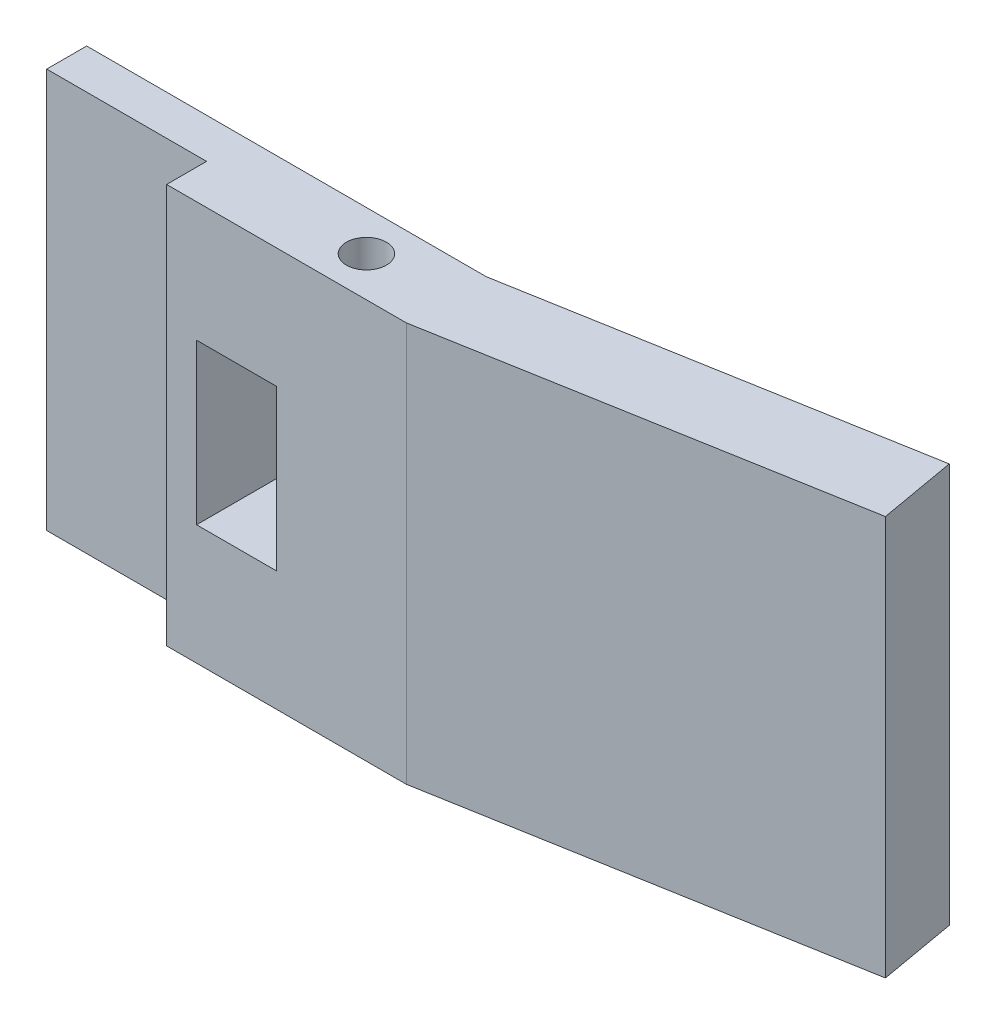
ISO-10303-21;
HEADER;
FILE_DESCRIPTION(('STEP AP214'),'2;1');
FILE_NAME('part.step','',(''),(''),'','','');
FILE_SCHEMA(('AUTOMOTIVE_DESIGN { 1 0 10303 214 1 1 1 1 }'));
ENDSEC;
DATA;
#1=APPLICATION_CONTEXT('core data for automotive mechanical design processes');
#2=APPLICATION_PROTOCOL_DEFINITION('international standard','automotive_design',2000,#1);
#3=PRODUCT_CONTEXT('',#1,'mechanical');
#4=PRODUCT('Part','Part','',(#3));
#5=PRODUCT_RELATED_PRODUCT_CATEGORY('part','',(#4));
#6=PRODUCT_DEFINITION_FORMATION('','',#4);
#7=PRODUCT_DEFINITION_CONTEXT('part definition',#1,'design');
#8=PRODUCT_DEFINITION('design','',#6,#7);
#9=PRODUCT_DEFINITION_SHAPE('','',#8);
#10=(LENGTH_UNIT() NAMED_UNIT(*) SI_UNIT(.MILLI.,.METRE.));
#11=(NAMED_UNIT(*) PLANE_ANGLE_UNIT() SI_UNIT($,.RADIAN.));
#12=(NAMED_UNIT(*) SI_UNIT($,.STERADIAN.) SOLID_ANGLE_UNIT());
#13=UNCERTAINTY_MEASURE_WITH_UNIT(LENGTH_MEASURE(1.E-05),#10,'distance_accuracy_value','');
#14=(GEOMETRIC_REPRESENTATION_CONTEXT(3) GLOBAL_UNCERTAINTY_ASSIGNED_CONTEXT((#13)) GLOBAL_UNIT_ASSIGNED_CONTEXT((#10,
#11,#12)) REPRESENTATION_CONTEXT('',''));
#15=CARTESIAN_POINT('',(0.,0.,0.));
#16=DIRECTION('',(0.,0.,1.));
#17=DIRECTION('',(1.,0.,0.));
#18=AXIS2_PLACEMENT_3D('',#15,#16,#17);
#19=CARTESIAN_POINT('',(25.4,31.75,3.175));
#20=DIRECTION('',(0.,-1.,0.));
#21=DIRECTION('',(0.,0.,-1.));
#22=AXIS2_PLACEMENT_3D('',#19,#20,#21);
#23=CYLINDRICAL_SURFACE('',#22,1.5875);
#24=CARTESIAN_POINT('',(25.4,31.75,3.175));
#25=DIRECTION('',(0.,1.,0.));
#26=DIRECTION('',(0.,0.,1.));
#27=AXIS2_PLACEMENT_3D('',#24,#25,#26);
#28=CIRCLE('',#27,1.5875);
#29=CARTESIAN_POINT('',(25.4,31.75,4.7625));
#30=VERTEX_POINT('',#29);
#31=EDGE_CURVE('E192',#30,#30,#28,.T.);
#32=ORIENTED_EDGE('',*,*,#31,.T.);
#33=EDGE_LOOP('',(#32));
#34=FACE_BOUND('',#33,.T.);
#35=CARTESIAN_POINT('',(25.4,0.,3.175));
#36=DIRECTION('',(0.,1.,0.));
#37=DIRECTION('',(0.,0.,1.));
#38=AXIS2_PLACEMENT_3D('',#35,#36,#37);
#39=CIRCLE('',#38,1.5875);
#40=CARTESIAN_POINT('',(25.4,0.,4.7625));
#41=VERTEX_POINT('',#40);
#42=EDGE_CURVE('E174',#41,#41,#39,.T.);
#43=ORIENTED_EDGE('',*,*,#42,.F.);
#44=EDGE_LOOP('',(#43));
#45=FACE_BOUND('',#44,.T.);
#46=ADVANCED_FACE('F44',(#34,#45),#23,.F.);
#47=CARTESIAN_POINT('',(62.060266513114,31.75,-10.9428994162196));
#48=DIRECTION('',(0.984807753012209,0.,-0.173648177666923));
#49=DIRECTION('',(-0.173648177666923,0.,-0.984807753012209));
#50=AXIS2_PLACEMENT_3D('',#47,#48,#49);
#51=PLANE('',#50);
#52=DIRECTION('',(0.173648177666923,0.,0.984807753012209));
#53=VECTOR('',#52,1.);
#54=CARTESIAN_POINT('',(62.060266513114,0.,-10.9428994162196));
#55=LINE('',#54,#53);
#56=CARTESIAN_POINT('',(63.0176461581377,0.,-5.51332964092484));
#57=VERTEX_POINT('',#56);
#58=CARTESIAN_POINT('',(64.1035601131966,0.,0.645194430070445));
#59=VERTEX_POINT('',#58);
#60=EDGE_CURVE('E201',#57,#59,#55,.T.);
#61=ORIENTED_EDGE('',*,*,#60,.F.);
#62=DIRECTION('',(0.,-1.,0.));
#63=VECTOR('',#62,1.);
#64=CARTESIAN_POINT('',(63.0176461581377,31.75,-5.51332964092484));
#65=LINE('',#64,#63);
#66=CARTESIAN_POINT('',(63.0176461581377,31.75,-5.51332964092484));
#67=VERTEX_POINT('',#66);
#68=EDGE_CURVE('E233',#67,#57,#65,.T.);
#69=ORIENTED_EDGE('',*,*,#68,.F.);
#70=DIRECTION('',(0.173648177666923,0.,0.984807753012209));
#71=VECTOR('',#70,1.);
#72=CARTESIAN_POINT('',(62.060266513114,31.75,-10.9428994162196));
#73=LINE('',#72,#71);
#74=CARTESIAN_POINT('',(64.1035601131966,31.75,0.645194430070445));
#75=VERTEX_POINT('',#74);
#76=EDGE_CURVE('E173',#67,#75,#73,.T.);
#77=ORIENTED_EDGE('',*,*,#76,.T.);
#78=DIRECTION('',(0.,-1.,0.));
#79=VECTOR('',#78,1.);
#80=CARTESIAN_POINT('',(64.1035601131966,31.75,0.645194430070445));
#81=LINE('',#80,#79);
#82=EDGE_CURVE('E236',#75,#59,#81,.T.);
#83=ORIENTED_EDGE('',*,*,#82,.T.);
#84=EDGE_LOOP('',(#61,#69,#77,#83));
#85=FACE_BOUND('',#84,.T.);
#86=ADVANCED_FACE('F289',(#85),#51,.T.);
#87=CARTESIAN_POINT('',(2.04329360008259,31.75,11.5880938462901));
#88=DIRECTION('',(0.173648177666924,0.,0.984807753012209));
#89=DIRECTION('',(0.984807753012209,0.,-0.173648177666924));
#90=AXIS2_PLACEMENT_3D('',#87,#88,#89);
#91=PLANE('',#90);
#92=DIRECTION('',(-0.984807753012209,0.,0.173648177666924));
#93=VECTOR('',#92,1.);
#94=CARTESIAN_POINT('',(2.04329360008259,0.,11.5880938462901));
#95=LINE('',#94,#93);
#96=CARTESIAN_POINT('',(31.75,0.,6.35));
#97=VERTEX_POINT('',#96);
#98=EDGE_CURVE('E197',#59,#97,#95,.T.);
#99=ORIENTED_EDGE('',*,*,#98,.F.);
#100=ORIENTED_EDGE('',*,*,#82,.F.);
#101=DIRECTION('',(-0.984807753012209,0.,0.173648177666924));
#102=VECTOR('',#101,1.);
#103=CARTESIAN_POINT('',(2.04329360008259,31.75,11.5880938462901));
#104=LINE('',#103,#102);
#105=CARTESIAN_POINT('',(31.75,31.75,6.35));
#106=VERTEX_POINT('',#105);
#107=EDGE_CURVE('E169',#75,#106,#104,.T.);
#108=ORIENTED_EDGE('',*,*,#107,.T.);
#109=DIRECTION('',(0.,-1.,0.));
#110=VECTOR('',#109,1.);
#111=CARTESIAN_POINT('',(31.75,31.75,6.35));
#112=LINE('',#111,#110);
#113=EDGE_CURVE('E196',#106,#97,#112,.T.);
#114=ORIENTED_EDGE('',*,*,#113,.T.);
#115=EDGE_LOOP('',(#99,#100,#108,#114));
#116=FACE_BOUND('',#115,.T.);
#117=ADVANCED_FACE('F295',(#116),#91,.T.);
#118=CARTESIAN_POINT('',(0.957379645023635,31.75,5.4295697752948));
#119=DIRECTION('',(-0.173648177666924,0.,-0.984807753012209));
#120=DIRECTION('',(-0.984807753012209,0.,0.173648177666924));
#121=AXIS2_PLACEMENT_3D('',#118,#119,#120);
#122=PLANE('',#121);
#123=DIRECTION('',(0.984807753012209,0.,-0.173648177666924));
#124=VECTOR('',#123,1.);
#125=CARTESIAN_POINT('',(0.957379645023635,0.,5.4295697752948));
#126=LINE('',#125,#124);
#127=CARTESIAN_POINT('',(31.75,0.,0.));
#128=VERTEX_POINT('',#127);
#129=EDGE_CURVE('E206',#128,#57,#126,.T.);
#130=ORIENTED_EDGE('',*,*,#129,.F.);
#131=DIRECTION('',(0.,-1.,0.));
#132=VECTOR('',#131,1.);
#133=CARTESIAN_POINT('',(31.75,31.75,0.));
#134=LINE('',#133,#132);
#135=CARTESIAN_POINT('',(31.75,31.75,0.));
#136=VERTEX_POINT('',#135);
#137=EDGE_CURVE('E230',#136,#128,#134,.T.);
#138=ORIENTED_EDGE('',*,*,#137,.F.);
#139=DIRECTION('',(0.984807753012209,0.,-0.173648177666924));
#140=VECTOR('',#139,1.);
#141=CARTESIAN_POINT('',(0.957379645023635,31.75,5.4295697752948));
#142=LINE('',#141,#140);
#143=EDGE_CURVE('E178',#136,#67,#142,.T.);
#144=ORIENTED_EDGE('',*,*,#143,.T.);
#145=ORIENTED_EDGE('',*,*,#68,.T.);
#146=EDGE_LOOP('',(#130,#138,#144,#145));
#147=FACE_BOUND('',#146,.T.);
#148=ADVANCED_FACE('F304',(#147),#122,.T.);
#149=CARTESIAN_POINT('',(0.,31.75,6.35));
#150=DIRECTION('',(0.,0.,-1.));
#151=DIRECTION('',(-1.,0.,0.));
#152=AXIS2_PLACEMENT_3D('',#149,#150,#151);
#153=PLANE('',#152);
#154=DIRECTION('',(1.,0.,0.));
#155=VECTOR('',#154,1.);
#156=CARTESIAN_POINT('',(15.08125,9.525,6.35));
#157=LINE('',#156,#155);
#158=CARTESIAN_POINT('',(15.08125,9.525,6.35));
#159=VERTEX_POINT('',#158);
#160=CARTESIAN_POINT('',(21.43125,9.525,6.35));
#161=VERTEX_POINT('',#160);
#162=EDGE_CURVE('E146',#159,#161,#157,.T.);
#163=ORIENTED_EDGE('',*,*,#162,.F.);
#164=DIRECTION('',(0.,-1.,0.));
#165=VECTOR('',#164,1.);
#166=CARTESIAN_POINT('',(15.08125,22.225,6.35));
#167=LINE('',#166,#165);
#168=CARTESIAN_POINT('',(15.08125,22.225,6.35));
#169=VERTEX_POINT('',#168);
#170=EDGE_CURVE('E60',#169,#159,#167,.T.);
#171=ORIENTED_EDGE('',*,*,#170,.F.);
#172=DIRECTION('',(-1.,0.,0.));
#173=VECTOR('',#172,1.);
#174=CARTESIAN_POINT('',(15.08125,22.225,6.35));
#175=LINE('',#174,#173);
#176=CARTESIAN_POINT('',(21.43125,22.225,6.35));
#177=VERTEX_POINT('',#176);
#178=EDGE_CURVE('E154',#177,#169,#175,.T.);
#179=ORIENTED_EDGE('',*,*,#178,.F.);
#180=DIRECTION('',(0.,1.,0.));
#181=VECTOR('',#180,1.);
#182=CARTESIAN_POINT('',(21.43125,22.225,6.35));
#183=LINE('',#182,#181);
#184=EDGE_CURVE('E136',#161,#177,#183,.T.);
#185=ORIENTED_EDGE('',*,*,#184,.F.);
#186=EDGE_LOOP('',(#163,#171,#179,#185));
#187=FACE_BOUND('',#186,.T.);
#188=DIRECTION('',(1.,0.,0.));
#189=VECTOR('',#188,1.);
#190=CARTESIAN_POINT('',(0.,0.,6.35));
#191=LINE('',#190,#189);
#192=CARTESIAN_POINT('',(12.7,0.,6.35));
#193=VERTEX_POINT('',#192);
#194=EDGE_CURVE('E217',#193,#97,#191,.T.);
#195=ORIENTED_EDGE('',*,*,#194,.T.);
#196=ORIENTED_EDGE('',*,*,#113,.F.);
#197=DIRECTION('',(1.,0.,0.));
#198=VECTOR('',#197,1.);
#199=CARTESIAN_POINT('',(0.,31.75,6.35));
#200=LINE('',#199,#198);
#201=CARTESIAN_POINT('',(12.7,31.75,6.35));
#202=VERTEX_POINT('',#201);
#203=EDGE_CURVE('E189',#202,#106,#200,.T.);
#204=ORIENTED_EDGE('',*,*,#203,.F.);
#205=DIRECTION('',(0.,-1.,0.));
#206=VECTOR('',#205,1.);
#207=CARTESIAN_POINT('',(12.7,31.75,6.35));
#208=LINE('',#207,#206);
#209=EDGE_CURVE('E226',#202,#193,#208,.T.);
#210=ORIENTED_EDGE('',*,*,#209,.T.);
#211=EDGE_LOOP('',(#195,#196,#204,#210));
#212=FACE_BOUND('',#211,.T.);
#213=ADVANCED_FACE('F151',(#187,#212),#153,.F.);
#214=CARTESIAN_POINT('',(0.,0.,0.));
#215=DIRECTION('',(0.,1.,0.));
#216=DIRECTION('',(0.,0.,1.));
#217=AXIS2_PLACEMENT_3D('',#214,#215,#216);
#218=PLANE('',#217);
#219=ORIENTED_EDGE('',*,*,#98,.T.);
#220=ORIENTED_EDGE('',*,*,#194,.F.);
#221=DIRECTION('',(0.,0.,1.));
#222=VECTOR('',#221,1.);
#223=CARTESIAN_POINT('',(12.7,0.,0.));
#224=LINE('',#223,#222);
#225=CARTESIAN_POINT('',(12.7,0.,3.175));
#226=VERTEX_POINT('',#225);
#227=EDGE_CURVE('E214',#226,#193,#224,.T.);
#228=ORIENTED_EDGE('',*,*,#227,.F.);
#229=DIRECTION('',(1.,0.,0.));
#230=VECTOR('',#229,1.);
#231=CARTESIAN_POINT('',(0.,0.,3.175));
#232=LINE('',#231,#230);
#233=CARTESIAN_POINT('',(0.,0.,3.175));
#234=VERTEX_POINT('',#233);
#235=EDGE_CURVE('E164',#234,#226,#232,.T.);
#236=ORIENTED_EDGE('',*,*,#235,.F.);
#237=DIRECTION('',(0.,0.,1.));
#238=VECTOR('',#237,1.);
#239=CARTESIAN_POINT('',(0.,0.,0.));
#240=LINE('',#239,#238);
#241=CARTESIAN_POINT('',(0.,0.,0.));
#242=VERTEX_POINT('',#241);
#243=EDGE_CURVE('E245',#242,#234,#240,.T.);
#244=ORIENTED_EDGE('',*,*,#243,.F.);
#245=DIRECTION('',(1.,0.,0.));
#246=VECTOR('',#245,1.);
#247=CARTESIAN_POINT('',(0.,0.,0.));
#248=LINE('',#247,#246);
#249=EDGE_CURVE('E210',#242,#128,#248,.T.);
#250=ORIENTED_EDGE('',*,*,#249,.T.);
#251=ORIENTED_EDGE('',*,*,#129,.T.);
#252=ORIENTED_EDGE('',*,*,#60,.T.);
#253=EDGE_LOOP('',(#219,#220,#228,#236,#244,#250,#251,#252));
#254=FACE_BOUND('',#253,.T.);
#255=ORIENTED_EDGE('',*,*,#42,.T.);
#256=EDGE_LOOP('',(#255));
#257=FACE_BOUND('',#256,.T.);
#258=ADVANCED_FACE('F301',(#254,#257),#218,.F.);
#259=CARTESIAN_POINT('',(0.,31.75,0.));
#260=DIRECTION('',(0.,1.,0.));
#261=DIRECTION('',(0.,0.,1.));
#262=AXIS2_PLACEMENT_3D('',#259,#260,#261);
#263=PLANE('',#262);
#264=ORIENTED_EDGE('',*,*,#107,.F.);
#265=ORIENTED_EDGE('',*,*,#76,.F.);
#266=ORIENTED_EDGE('',*,*,#143,.F.);
#267=DIRECTION('',(1.,0.,0.));
#268=VECTOR('',#267,1.);
#269=CARTESIAN_POINT('',(0.,31.75,0.));
#270=LINE('',#269,#268);
#271=CARTESIAN_POINT('',(0.,31.75,0.));
#272=VERTEX_POINT('',#271);
#273=EDGE_CURVE('E182',#272,#136,#270,.T.);
#274=ORIENTED_EDGE('',*,*,#273,.F.);
#275=DIRECTION('',(0.,0.,1.));
#276=VECTOR('',#275,1.);
#277=CARTESIAN_POINT('',(0.,31.75,0.));
#278=LINE('',#277,#276);
#279=CARTESIAN_POINT('',(0.,31.75,3.175));
#280=VERTEX_POINT('',#279);
#281=EDGE_CURVE('E244',#272,#280,#278,.T.);
#282=ORIENTED_EDGE('',*,*,#281,.T.);
#283=DIRECTION('',(1.,0.,0.));
#284=VECTOR('',#283,1.);
#285=CARTESIAN_POINT('',(0.,31.75,3.175));
#286=LINE('',#285,#284);
#287=CARTESIAN_POINT('',(12.7,31.75,3.175));
#288=VERTEX_POINT('',#287);
#289=EDGE_CURVE('E240',#280,#288,#286,.T.);
#290=ORIENTED_EDGE('',*,*,#289,.T.);
#291=DIRECTION('',(0.,0.,1.));
#292=VECTOR('',#291,1.);
#293=CARTESIAN_POINT('',(12.7,31.75,0.));
#294=LINE('',#293,#292);
#295=EDGE_CURVE('E186',#288,#202,#294,.T.);
#296=ORIENTED_EDGE('',*,*,#295,.T.);
#297=ORIENTED_EDGE('',*,*,#203,.T.);
#298=EDGE_LOOP('',(#264,#265,#266,#274,#282,#290,#296,#297));
#299=FACE_BOUND('',#298,.T.);
#300=ORIENTED_EDGE('',*,*,#31,.F.);
#301=EDGE_LOOP('',(#300));
#302=FACE_BOUND('',#301,.T.);
#303=ADVANCED_FACE('F308',(#299,#302),#263,.T.);
#304=CARTESIAN_POINT('',(12.7,31.75,0.));
#305=DIRECTION('',(1.,0.,0.));
#306=DIRECTION('',(0.,0.,-1.));
#307=AXIS2_PLACEMENT_3D('',#304,#305,#306);
#308=PLANE('',#307);
#309=ORIENTED_EDGE('',*,*,#295,.F.);
#310=DIRECTION('',(0.,-1.,0.));
#311=VECTOR('',#310,1.);
#312=CARTESIAN_POINT('',(12.7,31.75,3.175));
#313=LINE('',#312,#311);
#314=EDGE_CURVE('E239',#288,#226,#313,.T.);
#315=ORIENTED_EDGE('',*,*,#314,.T.);
#316=ORIENTED_EDGE('',*,*,#227,.T.);
#317=ORIENTED_EDGE('',*,*,#209,.F.);
#318=EDGE_LOOP('',(#309,#315,#316,#317));
#319=FACE_BOUND('',#318,.T.);
#320=ADVANCED_FACE('F305',(#319),#308,.F.);
#321=CARTESIAN_POINT('',(0.,31.75,0.));
#322=DIRECTION('',(0.,0.,-1.));
#323=DIRECTION('',(-1.,0.,0.));
#324=AXIS2_PLACEMENT_3D('',#321,#322,#323);
#325=PLANE('',#324);
#326=DIRECTION('',(0.,1.,0.));
#327=VECTOR('',#326,1.);
#328=CARTESIAN_POINT('',(15.08125,31.75,0.));
#329=LINE('',#328,#327);
#330=CARTESIAN_POINT('',(15.08125,9.525,0.));
#331=VERTEX_POINT('',#330);
#332=CARTESIAN_POINT('',(15.08125,22.225,0.));
#333=VERTEX_POINT('',#332);
#334=EDGE_CURVE('E11',#331,#333,#329,.T.);
#335=ORIENTED_EDGE('',*,*,#334,.F.);
#336=DIRECTION('',(-1.,0.,0.));
#337=VECTOR('',#336,1.);
#338=CARTESIAN_POINT('',(0.,9.52499999999999,0.));
#339=LINE('',#338,#337);
#340=CARTESIAN_POINT('',(21.43125,9.525,0.));
#341=VERTEX_POINT('',#340);
#342=EDGE_CURVE('E262',#341,#331,#339,.T.);
#343=ORIENTED_EDGE('',*,*,#342,.F.);
#344=DIRECTION('',(0.,-1.,0.));
#345=VECTOR('',#344,1.);
#346=CARTESIAN_POINT('',(21.43125,31.75,0.));
#347=LINE('',#346,#345);
#348=CARTESIAN_POINT('',(21.43125,22.225,0.));
#349=VERTEX_POINT('',#348);
#350=EDGE_CURVE('E139',#349,#341,#347,.T.);
#351=ORIENTED_EDGE('',*,*,#350,.F.);
#352=DIRECTION('',(1.,0.,0.));
#353=VECTOR('',#352,1.);
#354=CARTESIAN_POINT('',(0.,22.225,0.));
#355=LINE('',#354,#353);
#356=EDGE_CURVE('E53',#333,#349,#355,.T.);
#357=ORIENTED_EDGE('',*,*,#356,.F.);
#358=EDGE_LOOP('',(#335,#343,#351,#357));
#359=FACE_BOUND('',#358,.T.);
#360=ORIENTED_EDGE('',*,*,#249,.F.);
#361=DIRECTION('',(0.,-1.,0.));
#362=VECTOR('',#361,1.);
#363=CARTESIAN_POINT('',(0.,31.75,0.));
#364=LINE('',#363,#362);
#365=EDGE_CURVE('E202',#272,#242,#364,.T.);
#366=ORIENTED_EDGE('',*,*,#365,.F.);
#367=ORIENTED_EDGE('',*,*,#273,.T.);
#368=ORIENTED_EDGE('',*,*,#137,.T.);
#369=EDGE_LOOP('',(#360,#366,#367,#368));
#370=FACE_BOUND('',#369,.T.);
#371=ADVANCED_FACE('F273',(#359,#370),#325,.T.);
#372=CARTESIAN_POINT('',(0.,31.75,0.));
#373=DIRECTION('',(1.,0.,0.));
#374=DIRECTION('',(0.,0.,-1.));
#375=AXIS2_PLACEMENT_3D('',#372,#373,#374);
#376=PLANE('',#375);
#377=ORIENTED_EDGE('',*,*,#243,.T.);
#378=DIRECTION('',(0.,-1.,0.));
#379=VECTOR('',#378,1.);
#380=CARTESIAN_POINT('',(0.,31.75,3.175));
#381=LINE('',#380,#379);
#382=EDGE_CURVE('E248',#280,#234,#381,.T.);
#383=ORIENTED_EDGE('',*,*,#382,.F.);
#384=ORIENTED_EDGE('',*,*,#281,.F.);
#385=ORIENTED_EDGE('',*,*,#365,.T.);
#386=EDGE_LOOP('',(#377,#383,#384,#385));
#387=FACE_BOUND('',#386,.T.);
#388=ADVANCED_FACE('F284',(#387),#376,.F.);
#389=CARTESIAN_POINT('',(0.,31.75,3.175));
#390=DIRECTION('',(0.,0.,-1.));
#391=DIRECTION('',(-1.,0.,0.));
#392=AXIS2_PLACEMENT_3D('',#389,#390,#391);
#393=PLANE('',#392);
#394=ORIENTED_EDGE('',*,*,#235,.T.);
#395=ORIENTED_EDGE('',*,*,#314,.F.);
#396=ORIENTED_EDGE('',*,*,#289,.F.);
#397=ORIENTED_EDGE('',*,*,#382,.T.);
#398=EDGE_LOOP('',(#394,#395,#396,#397));
#399=FACE_BOUND('',#398,.T.);
#400=ADVANCED_FACE('F46',(#399),#393,.F.);
#401=CARTESIAN_POINT('',(15.08125,22.225,-5.51332964092484));
#402=DIRECTION('',(-1.,0.,0.));
#403=DIRECTION('',(0.,0.,1.));
#404=AXIS2_PLACEMENT_3D('',#401,#402,#403);
#405=PLANE('',#404);
#406=ORIENTED_EDGE('',*,*,#334,.T.);
#407=DIRECTION('',(0.,0.,1.));
#408=VECTOR('',#407,1.);
#409=CARTESIAN_POINT('',(15.08125,22.225,-5.51332964092484));
#410=LINE('',#409,#408);
#411=EDGE_CURVE('E161',#333,#169,#410,.T.);
#412=ORIENTED_EDGE('',*,*,#411,.T.);
#413=ORIENTED_EDGE('',*,*,#170,.T.);
#414=DIRECTION('',(0.,0.,1.));
#415=VECTOR('',#414,1.);
#416=CARTESIAN_POINT('',(15.08125,9.525,-5.51332964092484));
#417=LINE('',#416,#415);
#418=EDGE_CURVE('E143',#331,#159,#417,.T.);
#419=ORIENTED_EDGE('',*,*,#418,.F.);
#420=EDGE_LOOP('',(#406,#412,#413,#419));
#421=FACE_BOUND('',#420,.T.);
#422=ADVANCED_FACE('F275',(#421),#405,.F.);
#423=CARTESIAN_POINT('',(15.08125,22.225,-5.51332964092484));
#424=DIRECTION('',(0.,1.,0.));
#425=DIRECTION('',(0.,0.,1.));
#426=AXIS2_PLACEMENT_3D('',#423,#424,#425);
#427=PLANE('',#426);
#428=ORIENTED_EDGE('',*,*,#356,.T.);
#429=DIRECTION('',(0.,0.,1.));
#430=VECTOR('',#429,1.);
#431=CARTESIAN_POINT('',(21.43125,22.225,-5.51332964092484));
#432=LINE('',#431,#430);
#433=EDGE_CURVE('E142',#349,#177,#432,.T.);
#434=ORIENTED_EDGE('',*,*,#433,.T.);
#435=ORIENTED_EDGE('',*,*,#178,.T.);
#436=ORIENTED_EDGE('',*,*,#411,.F.);
#437=EDGE_LOOP('',(#428,#434,#435,#436));
#438=FACE_BOUND('',#437,.T.);
#439=ADVANCED_FACE('F270',(#438),#427,.F.);
#440=CARTESIAN_POINT('',(21.43125,22.225,-5.51332964092484));
#441=DIRECTION('',(1.,0.,0.));
#442=DIRECTION('',(0.,0.,-1.));
#443=AXIS2_PLACEMENT_3D('',#440,#441,#442);
#444=PLANE('',#443);
#445=ORIENTED_EDGE('',*,*,#350,.T.);
#446=DIRECTION('',(0.,0.,1.));
#447=VECTOR('',#446,1.);
#448=CARTESIAN_POINT('',(21.43125,9.525,-5.51332964092484));
#449=LINE('',#448,#447);
#450=EDGE_CURVE('E68',#341,#161,#449,.T.);
#451=ORIENTED_EDGE('',*,*,#450,.T.);
#452=ORIENTED_EDGE('',*,*,#184,.T.);
#453=ORIENTED_EDGE('',*,*,#433,.F.);
#454=EDGE_LOOP('',(#445,#451,#452,#453));
#455=FACE_BOUND('',#454,.T.);
#456=ADVANCED_FACE('F133',(#455),#444,.F.);
#457=CARTESIAN_POINT('',(15.08125,9.525,-5.51332964092484));
#458=DIRECTION('',(0.,-1.,0.));
#459=DIRECTION('',(1.,0.,0.));
#460=AXIS2_PLACEMENT_3D('',#457,#458,#459);
#461=PLANE('',#460);
#462=ORIENTED_EDGE('',*,*,#342,.T.);
#463=ORIENTED_EDGE('',*,*,#418,.T.);
#464=ORIENTED_EDGE('',*,*,#162,.T.);
#465=ORIENTED_EDGE('',*,*,#450,.F.);
#466=EDGE_LOOP('',(#462,#463,#464,#465));
#467=FACE_BOUND('',#466,.T.);
#468=ADVANCED_FACE('F147',(#467),#461,.F.);
#469=CLOSED_SHELL('',(#46,#86,#117,#148,#213,#258,#303,#320,#371,#388,#400,#422,#439,#456,#468));
#470=MANIFOLD_SOLID_BREP('B2',#469);
#471=ADVANCED_BREP_SHAPE_REPRESENTATION('',(#18,#470),#14);
#472=SHAPE_DEFINITION_REPRESENTATION(#9,#471);
ENDSEC;
END-ISO-10303-21;
